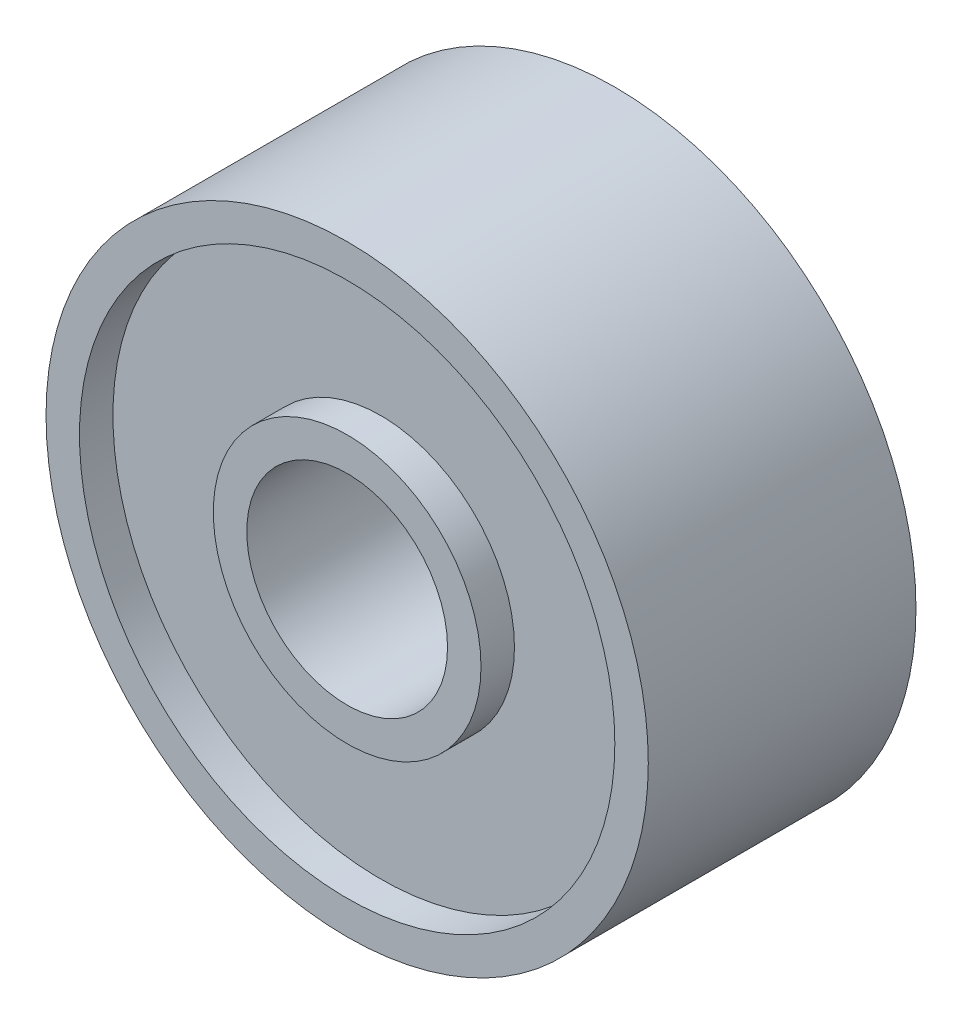
ISO-10303-21;
HEADER;
FILE_DESCRIPTION(('STEP AP214'),'2;1');
FILE_NAME('part.step','',(''),(''),'','','');
FILE_SCHEMA(('AUTOMOTIVE_DESIGN { 1 0 10303 214 1 1 1 1 }'));
ENDSEC;
DATA;
#1=APPLICATION_CONTEXT('core data for automotive mechanical design processes');
#2=APPLICATION_PROTOCOL_DEFINITION('international standard','automotive_design',2000,#1);
#3=PRODUCT_CONTEXT('',#1,'mechanical');
#4=PRODUCT('Part','Part','',(#3));
#5=PRODUCT_RELATED_PRODUCT_CATEGORY('part','',(#4));
#6=PRODUCT_DEFINITION_FORMATION('','',#4);
#7=PRODUCT_DEFINITION_CONTEXT('part definition',#1,'design');
#8=PRODUCT_DEFINITION('design','',#6,#7);
#9=PRODUCT_DEFINITION_SHAPE('','',#8);
#10=(LENGTH_UNIT() NAMED_UNIT(*) SI_UNIT(.MILLI.,.METRE.));
#11=(NAMED_UNIT(*) PLANE_ANGLE_UNIT() SI_UNIT($,.RADIAN.));
#12=(NAMED_UNIT(*) SI_UNIT($,.STERADIAN.) SOLID_ANGLE_UNIT());
#13=UNCERTAINTY_MEASURE_WITH_UNIT(LENGTH_MEASURE(1.E-05),#10,'distance_accuracy_value','');
#14=(GEOMETRIC_REPRESENTATION_CONTEXT(3) GLOBAL_UNCERTAINTY_ASSIGNED_CONTEXT((#13)) GLOBAL_UNIT_ASSIGNED_CONTEXT((#10,
#11,#12)) REPRESENTATION_CONTEXT('',''));
#15=CARTESIAN_POINT('',(0.,0.,0.));
#16=DIRECTION('',(0.,0.,1.));
#17=DIRECTION('',(1.,0.,0.));
#18=AXIS2_PLACEMENT_3D('',#15,#16,#17);
#19=CARTESIAN_POINT('',(0.,0.,-2.));
#20=DIRECTION('',(0.,0.,1.));
#21=DIRECTION('',(1.,0.,0.));
#22=AXIS2_PLACEMENT_3D('',#19,#20,#21);
#23=PLANE('',#22);
#24=CARTESIAN_POINT('',(0.,0.,-2.));
#25=DIRECTION('',(0.,0.,1.));
#26=DIRECTION('',(1.,0.,0.));
#27=AXIS2_PLACEMENT_3D('',#24,#25,#26);
#28=CIRCLE('',#27,1.5);
#29=CARTESIAN_POINT('',(1.5,0.,-2.));
#30=VERTEX_POINT('',#29);
#31=EDGE_CURVE('E45',#30,#30,#28,.T.);
#32=ORIENTED_EDGE('',*,*,#31,.T.);
#33=EDGE_LOOP('',(#32));
#34=FACE_BOUND('',#33,.T.);
#35=CARTESIAN_POINT('',(0.,0.,-2.));
#36=DIRECTION('',(0.,0.,1.));
#37=DIRECTION('',(1.,0.,0.));
#38=AXIS2_PLACEMENT_3D('',#35,#36,#37);
#39=CIRCLE('',#38,2.);
#40=CARTESIAN_POINT('',(2.,0.,-2.));
#41=VERTEX_POINT('',#40);
#42=EDGE_CURVE('E71',#41,#41,#39,.T.);
#43=ORIENTED_EDGE('',*,*,#42,.F.);
#44=EDGE_LOOP('',(#43));
#45=FACE_BOUND('',#44,.T.);
#46=ADVANCED_FACE('F34',(#34,#45),#23,.F.);
#47=CARTESIAN_POINT('',(0.,0.,2.));
#48=DIRECTION('',(0.,0.,1.));
#49=DIRECTION('',(1.,0.,0.));
#50=AXIS2_PLACEMENT_3D('',#47,#48,#49);
#51=PLANE('',#50);
#52=CARTESIAN_POINT('',(0.,0.,2.));
#53=DIRECTION('',(0.,0.,1.));
#54=DIRECTION('',(1.,0.,0.));
#55=AXIS2_PLACEMENT_3D('',#52,#53,#54);
#56=CIRCLE('',#55,1.5);
#57=CARTESIAN_POINT('',(1.5,0.,2.));
#58=VERTEX_POINT('',#57);
#59=EDGE_CURVE('E47',#58,#58,#56,.T.);
#60=ORIENTED_EDGE('',*,*,#59,.F.);
#61=EDGE_LOOP('',(#60));
#62=FACE_BOUND('',#61,.T.);
#63=CARTESIAN_POINT('',(0.,0.,2.));
#64=DIRECTION('',(0.,0.,1.));
#65=DIRECTION('',(1.,0.,0.));
#66=AXIS2_PLACEMENT_3D('',#63,#64,#65);
#67=CIRCLE('',#66,2.);
#68=CARTESIAN_POINT('',(2.,0.,2.));
#69=VERTEX_POINT('',#68);
#70=EDGE_CURVE('E59',#69,#69,#67,.T.);
#71=ORIENTED_EDGE('',*,*,#70,.T.);
#72=EDGE_LOOP('',(#71));
#73=FACE_BOUND('',#72,.T.);
#74=ADVANCED_FACE('F87',(#62,#73),#51,.T.);
#75=CARTESIAN_POINT('',(0.,0.,2.));
#76=DIRECTION('',(0.,0.,-1.));
#77=DIRECTION('',(-1.,0.,0.));
#78=AXIS2_PLACEMENT_3D('',#75,#76,#77);
#79=CYLINDRICAL_SURFACE('',#78,4.5);
#80=CARTESIAN_POINT('',(0.,0.,2.));
#81=DIRECTION('',(0.,0.,1.));
#82=DIRECTION('',(1.,0.,0.));
#83=AXIS2_PLACEMENT_3D('',#80,#81,#82);
#84=CIRCLE('',#83,4.5);
#85=CARTESIAN_POINT('',(4.5,0.,2.));
#86=VERTEX_POINT('',#85);
#87=EDGE_CURVE('E10',#86,#86,#84,.T.);
#88=ORIENTED_EDGE('',*,*,#87,.F.);
#89=EDGE_LOOP('',(#88));
#90=FACE_BOUND('',#89,.T.);
#91=CARTESIAN_POINT('',(0.,0.,-2.));
#92=DIRECTION('',(0.,0.,1.));
#93=DIRECTION('',(1.,0.,0.));
#94=AXIS2_PLACEMENT_3D('',#91,#92,#93);
#95=CIRCLE('',#94,4.5);
#96=CARTESIAN_POINT('',(4.5,0.,-2.));
#97=VERTEX_POINT('',#96);
#98=EDGE_CURVE('E38',#97,#97,#95,.T.);
#99=ORIENTED_EDGE('',*,*,#98,.T.);
#100=EDGE_LOOP('',(#99));
#101=FACE_BOUND('',#100,.T.);
#102=ADVANCED_FACE('F36',(#90,#101),#79,.T.);
#103=CARTESIAN_POINT('',(0.,0.,2.));
#104=DIRECTION('',(0.,0.,1.));
#105=DIRECTION('',(1.,0.,0.));
#106=AXIS2_PLACEMENT_3D('',#103,#104,#105);
#107=CIRCLE('',#106,4.);
#108=CARTESIAN_POINT('',(4.,0.,2.));
#109=VERTEX_POINT('',#108);
#110=EDGE_CURVE('E53',#109,#109,#107,.T.);
#111=ORIENTED_EDGE('',*,*,#110,.F.);
#112=EDGE_LOOP('',(#111));
#113=FACE_BOUND('',#112,.T.);
#114=ORIENTED_EDGE('',*,*,#87,.T.);
#115=EDGE_LOOP('',(#114));
#116=FACE_BOUND('',#115,.T.);
#117=ADVANCED_FACE('F95',(#113,#116),#51,.T.);
#118=CARTESIAN_POINT('',(0.,0.,-2.));
#119=DIRECTION('',(0.,0.,1.));
#120=DIRECTION('',(1.,0.,0.));
#121=AXIS2_PLACEMENT_3D('',#118,#119,#120);
#122=CIRCLE('',#121,4.);
#123=CARTESIAN_POINT('',(4.,0.,-2.));
#124=VERTEX_POINT('',#123);
#125=EDGE_CURVE('E65',#124,#124,#122,.T.);
#126=ORIENTED_EDGE('',*,*,#125,.T.);
#127=EDGE_LOOP('',(#126));
#128=FACE_BOUND('',#127,.T.);
#129=ORIENTED_EDGE('',*,*,#98,.F.);
#130=EDGE_LOOP('',(#129));
#131=FACE_BOUND('',#130,.T.);
#132=ADVANCED_FACE('F89',(#128,#131),#23,.F.);
#133=CARTESIAN_POINT('',(0.,0.,-2.));
#134=DIRECTION('',(0.,0.,1.));
#135=DIRECTION('',(1.,0.,0.));
#136=AXIS2_PLACEMENT_3D('',#133,#134,#135);
#137=CYLINDRICAL_SURFACE('',#136,1.5);
#138=ORIENTED_EDGE('',*,*,#31,.F.);
#139=EDGE_LOOP('',(#138));
#140=FACE_BOUND('',#139,.T.);
#141=ORIENTED_EDGE('',*,*,#59,.T.);
#142=EDGE_LOOP('',(#141));
#143=FACE_BOUND('',#142,.T.);
#144=ADVANCED_FACE('F97',(#140,#143),#137,.F.);
#145=CARTESIAN_POINT('',(0.,0.,1.5));
#146=DIRECTION('',(0.,0.,1.));
#147=DIRECTION('',(1.,0.,0.));
#148=AXIS2_PLACEMENT_3D('',#145,#146,#147);
#149=CYLINDRICAL_SURFACE('',#148,4.);
#150=CARTESIAN_POINT('',(0.,0.,1.5));
#151=DIRECTION('',(0.,0.,1.));
#152=DIRECTION('',(1.,0.,0.));
#153=AXIS2_PLACEMENT_3D('',#150,#151,#152);
#154=CIRCLE('',#153,4.);
#155=CARTESIAN_POINT('',(4.,0.,1.5));
#156=VERTEX_POINT('',#155);
#157=EDGE_CURVE('E50',#156,#156,#154,.T.);
#158=ORIENTED_EDGE('',*,*,#157,.F.);
#159=EDGE_LOOP('',(#158));
#160=FACE_BOUND('',#159,.T.);
#161=ORIENTED_EDGE('',*,*,#110,.T.);
#162=EDGE_LOOP('',(#161));
#163=FACE_BOUND('',#162,.T.);
#164=ADVANCED_FACE('F103',(#160,#163),#149,.F.);
#165=CARTESIAN_POINT('',(0.,0.,1.5));
#166=DIRECTION('',(0.,0.,1.));
#167=DIRECTION('',(1.,0.,0.));
#168=AXIS2_PLACEMENT_3D('',#165,#166,#167);
#169=PLANE('',#168);
#170=CARTESIAN_POINT('',(0.,0.,1.5));
#171=DIRECTION('',(0.,0.,1.));
#172=DIRECTION('',(1.,0.,0.));
#173=AXIS2_PLACEMENT_3D('',#170,#171,#172);
#174=CIRCLE('',#173,2.);
#175=CARTESIAN_POINT('',(2.,0.,1.5));
#176=VERTEX_POINT('',#175);
#177=EDGE_CURVE('E56',#176,#176,#174,.T.);
#178=ORIENTED_EDGE('',*,*,#177,.F.);
#179=EDGE_LOOP('',(#178));
#180=FACE_BOUND('',#179,.T.);
#181=ORIENTED_EDGE('',*,*,#157,.T.);
#182=EDGE_LOOP('',(#181));
#183=FACE_BOUND('',#182,.T.);
#184=ADVANCED_FACE('F134',(#180,#183),#169,.T.);
#185=CARTESIAN_POINT('',(0.,0.,1.5));
#186=DIRECTION('',(0.,0.,1.));
#187=DIRECTION('',(1.,0.,0.));
#188=AXIS2_PLACEMENT_3D('',#185,#186,#187);
#189=CYLINDRICAL_SURFACE('',#188,2.);
#190=ORIENTED_EDGE('',*,*,#177,.T.);
#191=EDGE_LOOP('',(#190));
#192=FACE_BOUND('',#191,.T.);
#193=ORIENTED_EDGE('',*,*,#70,.F.);
#194=EDGE_LOOP('',(#193));
#195=FACE_BOUND('',#194,.T.);
#196=ADVANCED_FACE('F144',(#192,#195),#189,.T.);
#197=CARTESIAN_POINT('',(0.,0.,-1.5));
#198=DIRECTION('',(0.,0.,-1.));
#199=DIRECTION('',(1.,0.,0.));
#200=AXIS2_PLACEMENT_3D('',#197,#198,#199);
#201=PLANE('',#200);
#202=CARTESIAN_POINT('',(0.,0.,-1.5));
#203=DIRECTION('',(0.,0.,1.));
#204=DIRECTION('',(1.,0.,0.));
#205=AXIS2_PLACEMENT_3D('',#202,#203,#204);
#206=CIRCLE('',#205,4.);
#207=CARTESIAN_POINT('',(4.,0.,-1.5));
#208=VERTEX_POINT('',#207);
#209=EDGE_CURVE('E62',#208,#208,#206,.T.);
#210=ORIENTED_EDGE('',*,*,#209,.F.);
#211=EDGE_LOOP('',(#210));
#212=FACE_BOUND('',#211,.T.);
#213=CARTESIAN_POINT('',(0.,0.,-1.5));
#214=DIRECTION('',(0.,0.,1.));
#215=DIRECTION('',(1.,0.,0.));
#216=AXIS2_PLACEMENT_3D('',#213,#214,#215);
#217=CIRCLE('',#216,2.);
#218=CARTESIAN_POINT('',(2.,0.,-1.5));
#219=VERTEX_POINT('',#218);
#220=EDGE_CURVE('E68',#219,#219,#217,.T.);
#221=ORIENTED_EDGE('',*,*,#220,.T.);
#222=EDGE_LOOP('',(#221));
#223=FACE_BOUND('',#222,.T.);
#224=ADVANCED_FACE('F77',(#212,#223),#201,.T.);
#225=CARTESIAN_POINT('',(0.,0.,-1.5));
#226=DIRECTION('',(0.,0.,-1.));
#227=DIRECTION('',(-1.,0.,0.));
#228=AXIS2_PLACEMENT_3D('',#225,#226,#227);
#229=CYLINDRICAL_SURFACE('',#228,4.);
#230=ORIENTED_EDGE('',*,*,#209,.T.);
#231=EDGE_LOOP('',(#230));
#232=FACE_BOUND('',#231,.T.);
#233=ORIENTED_EDGE('',*,*,#125,.F.);
#234=EDGE_LOOP('',(#233));
#235=FACE_BOUND('',#234,.T.);
#236=ADVANCED_FACE('F82',(#232,#235),#229,.F.);
#237=CARTESIAN_POINT('',(0.,0.,-1.5));
#238=DIRECTION('',(0.,0.,-1.));
#239=DIRECTION('',(-1.,0.,0.));
#240=AXIS2_PLACEMENT_3D('',#237,#238,#239);
#241=CYLINDRICAL_SURFACE('',#240,2.);
#242=ORIENTED_EDGE('',*,*,#220,.F.);
#243=EDGE_LOOP('',(#242));
#244=FACE_BOUND('',#243,.T.);
#245=ORIENTED_EDGE('',*,*,#42,.T.);
#246=EDGE_LOOP('',(#245));
#247=FACE_BOUND('',#246,.T.);
#248=ADVANCED_FACE('F79',(#244,#247),#241,.T.);
#249=CLOSED_SHELL('',(#46,#74,#102,#117,#132,#144,#164,#184,#196,#224,#236,#248));
#250=MANIFOLD_SOLID_BREP('B2',#249);
#251=ADVANCED_BREP_SHAPE_REPRESENTATION('',(#18,#250),#14);
#252=SHAPE_DEFINITION_REPRESENTATION(#9,#251);
ENDSEC;
END-ISO-10303-21;
